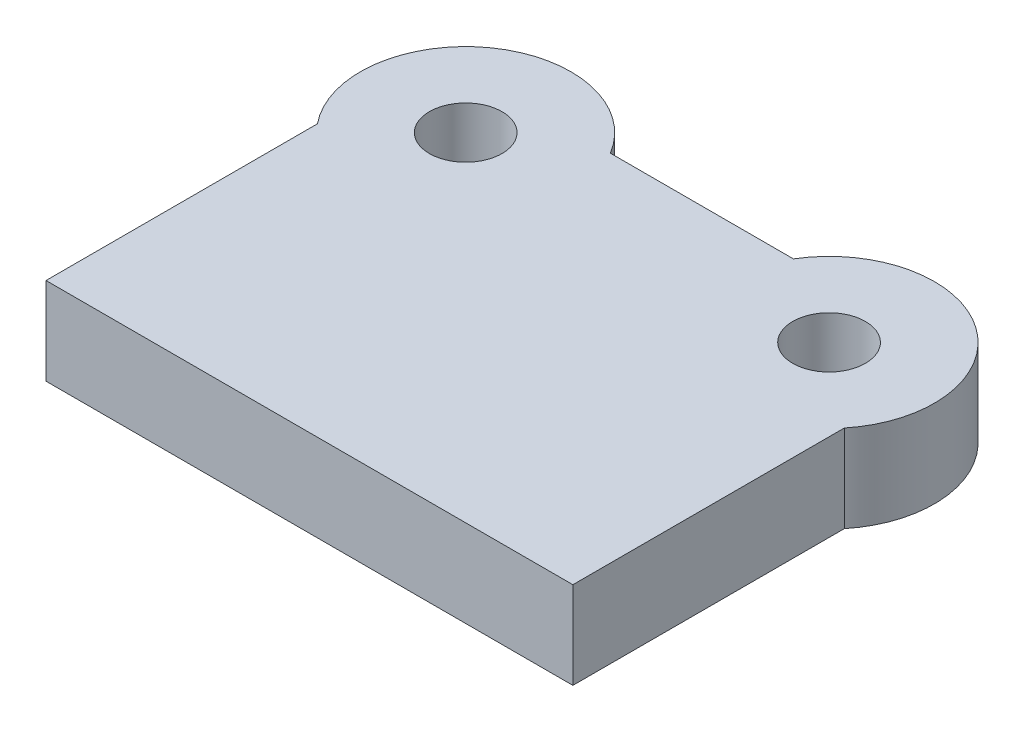
ISO-10303-21;
HEADER;
FILE_DESCRIPTION(('STEP AP214'),'2;1');
FILE_NAME('part.step','',(''),(''),'','','');
FILE_SCHEMA(('AUTOMOTIVE_DESIGN { 1 0 10303 214 1 1 1 1 }'));
ENDSEC;
DATA;
#1=APPLICATION_CONTEXT('core data for automotive mechanical design processes');
#2=APPLICATION_PROTOCOL_DEFINITION('international standard','automotive_design',2000,#1);
#3=PRODUCT_CONTEXT('',#1,'mechanical');
#4=PRODUCT('Part','Part','',(#3));
#5=PRODUCT_RELATED_PRODUCT_CATEGORY('part','',(#4));
#6=PRODUCT_DEFINITION_FORMATION('','',#4);
#7=PRODUCT_DEFINITION_CONTEXT('part definition',#1,'design');
#8=PRODUCT_DEFINITION('design','',#6,#7);
#9=PRODUCT_DEFINITION_SHAPE('','',#8);
#10=(LENGTH_UNIT() NAMED_UNIT(*) SI_UNIT(.MILLI.,.METRE.));
#11=(NAMED_UNIT(*) PLANE_ANGLE_UNIT() SI_UNIT($,.RADIAN.));
#12=(NAMED_UNIT(*) SI_UNIT($,.STERADIAN.) SOLID_ANGLE_UNIT());
#13=UNCERTAINTY_MEASURE_WITH_UNIT(LENGTH_MEASURE(1.E-05),#10,'distance_accuracy_value','');
#14=(GEOMETRIC_REPRESENTATION_CONTEXT(3) GLOBAL_UNCERTAINTY_ASSIGNED_CONTEXT((#13)) GLOBAL_UNIT_ASSIGNED_CONTEXT((#10,
#11,#12)) REPRESENTATION_CONTEXT('',''));
#15=CARTESIAN_POINT('',(0.,0.,0.));
#16=DIRECTION('',(0.,0.,1.));
#17=DIRECTION('',(1.,0.,0.));
#18=AXIS2_PLACEMENT_3D('',#15,#16,#17);
#19=CARTESIAN_POINT('',(-50.,24.,-93.));
#20=DIRECTION('',(0.,1.,0.));
#21=DIRECTION('',(0.,0.,1.));
#22=AXIS2_PLACEMENT_3D('',#19,#20,#21);
#23=PLANE('',#22);
#24=CARTESIAN_POINT('',(-50.,24.,-93.));
#25=DIRECTION('',(0.,1.,0.));
#26=DIRECTION('',(0.,0.,1.));
#27=AXIS2_PLACEMENT_3D('',#24,#25,#26);
#28=CIRCLE('',#27,10.);
#29=CARTESIAN_POINT('',(-50.,24.,-83.));
#30=VERTEX_POINT('',#29);
#31=EDGE_CURVE('E122',#30,#30,#28,.T.);
#32=ORIENTED_EDGE('',*,*,#31,.F.);
#33=EDGE_LOOP('',(#32));
#34=FACE_BOUND('',#33,.T.);
#35=DIRECTION('',(0.,0.,1.));
#36=VECTOR('',#35,1.);
#37=CARTESIAN_POINT('',(-72.5,24.,0.));
#38=LINE('',#37,#36);
#39=CARTESIAN_POINT('',(-72.5,24.,-74.703825536468));
#40=VERTEX_POINT('',#39);
#41=CARTESIAN_POINT('',(-72.5,24.,0.));
#42=VERTEX_POINT('',#41);
#43=EDGE_CURVE('E129',#40,#42,#38,.T.);
#44=ORIENTED_EDGE('',*,*,#43,.T.);
#45=DIRECTION('',(1.,0.,0.));
#46=VECTOR('',#45,1.);
#47=CARTESIAN_POINT('',(72.5,24.,0.));
#48=LINE('',#47,#46);
#49=CARTESIAN_POINT('',(72.5,24.,0.));
#50=VERTEX_POINT('',#49);
#51=EDGE_CURVE('E87',#42,#50,#48,.T.);
#52=ORIENTED_EDGE('',*,*,#51,.T.);
#53=DIRECTION('',(0.,0.,-1.));
#54=VECTOR('',#53,1.);
#55=CARTESIAN_POINT('',(72.5,24.,0.));
#56=LINE('',#55,#54);
#57=CARTESIAN_POINT('',(72.5,24.,-74.703825536468));
#58=VERTEX_POINT('',#57);
#59=EDGE_CURVE('E100',#50,#58,#56,.T.);
#60=ORIENTED_EDGE('',*,*,#59,.T.);
#61=CARTESIAN_POINT('',(50.,24.,-93.));
#62=DIRECTION('',(0.,1.,0.));
#63=DIRECTION('',(0.,0.,-1.));
#64=AXIS2_PLACEMENT_3D('',#61,#62,#63);
#65=CIRCLE('',#64,29.);
#66=CARTESIAN_POINT('',(25.1806527080183,24.,-108.));
#67=VERTEX_POINT('',#66);
#68=EDGE_CURVE('E94',#58,#67,#65,.T.);
#69=ORIENTED_EDGE('',*,*,#68,.T.);
#70=DIRECTION('',(-1.,0.,0.));
#71=VECTOR('',#70,1.);
#72=CARTESIAN_POINT('',(25.1806527080183,24.,-108.));
#73=LINE('',#72,#71);
#74=CARTESIAN_POINT('',(-25.1806527080183,24.,-108.));
#75=VERTEX_POINT('',#74);
#76=EDGE_CURVE('E98',#67,#75,#73,.T.);
#77=ORIENTED_EDGE('',*,*,#76,.T.);
#78=CARTESIAN_POINT('',(-50.,24.,-93.));
#79=DIRECTION('',(0.,1.,0.));
#80=DIRECTION('',(0.,0.,1.));
#81=AXIS2_PLACEMENT_3D('',#78,#79,#80);
#82=CIRCLE('',#81,29.);
#83=EDGE_CURVE('E50',#75,#40,#82,.T.);
#84=ORIENTED_EDGE('',*,*,#83,.T.);
#85=EDGE_LOOP('',(#44,#52,#60,#69,#77,#84));
#86=FACE_BOUND('',#85,.T.);
#87=CARTESIAN_POINT('',(50.,24.,-93.));
#88=DIRECTION('',(0.,1.,0.));
#89=DIRECTION('',(0.,0.,-1.));
#90=AXIS2_PLACEMENT_3D('',#87,#88,#89);
#91=CIRCLE('',#90,10.);
#92=CARTESIAN_POINT('',(50.,24.,-103.));
#93=VERTEX_POINT('',#92);
#94=EDGE_CURVE('E171',#93,#93,#91,.T.);
#95=ORIENTED_EDGE('',*,*,#94,.F.);
#96=EDGE_LOOP('',(#95));
#97=FACE_BOUND('',#96,.T.);
#98=ADVANCED_FACE('F33',(#34,#86,#97),#23,.T.);
#99=CARTESIAN_POINT('',(-50.,0.,-93.));
#100=DIRECTION('',(0.,1.,0.));
#101=DIRECTION('',(0.,0.,1.));
#102=AXIS2_PLACEMENT_3D('',#99,#100,#101);
#103=PLANE('',#102);
#104=DIRECTION('',(0.,0.,1.));
#105=VECTOR('',#104,1.);
#106=CARTESIAN_POINT('',(-72.5,0.,0.));
#107=LINE('',#106,#105);
#108=CARTESIAN_POINT('',(-72.5,0.,-74.703825536468));
#109=VERTEX_POINT('',#108);
#110=CARTESIAN_POINT('',(-72.5,0.,0.));
#111=VERTEX_POINT('',#110);
#112=EDGE_CURVE('E118',#109,#111,#107,.T.);
#113=ORIENTED_EDGE('',*,*,#112,.F.);
#114=CARTESIAN_POINT('',(-50.,0.,-93.));
#115=DIRECTION('',(0.,1.,0.));
#116=DIRECTION('',(0.,0.,1.));
#117=AXIS2_PLACEMENT_3D('',#114,#115,#116);
#118=CIRCLE('',#117,29.);
#119=CARTESIAN_POINT('',(-25.1806527080183,0.,-108.));
#120=VERTEX_POINT('',#119);
#121=EDGE_CURVE('E79',#120,#109,#118,.T.);
#122=ORIENTED_EDGE('',*,*,#121,.F.);
#123=DIRECTION('',(-1.,0.,0.));
#124=VECTOR('',#123,1.);
#125=CARTESIAN_POINT('',(25.1806527080183,0.,-108.));
#126=LINE('',#125,#124);
#127=CARTESIAN_POINT('',(25.1806527080183,0.,-108.));
#128=VERTEX_POINT('',#127);
#129=EDGE_CURVE('E73',#128,#120,#126,.T.);
#130=ORIENTED_EDGE('',*,*,#129,.F.);
#131=CARTESIAN_POINT('',(50.,0.,-93.));
#132=DIRECTION('',(0.,1.,0.));
#133=DIRECTION('',(0.,0.,-1.));
#134=AXIS2_PLACEMENT_3D('',#131,#132,#133);
#135=CIRCLE('',#134,29.);
#136=CARTESIAN_POINT('',(72.5,0.,-74.703825536468));
#137=VERTEX_POINT('',#136);
#138=EDGE_CURVE('E108',#137,#128,#135,.T.);
#139=ORIENTED_EDGE('',*,*,#138,.F.);
#140=DIRECTION('',(0.,0.,-1.));
#141=VECTOR('',#140,1.);
#142=CARTESIAN_POINT('',(72.5,0.,0.));
#143=LINE('',#142,#141);
#144=CARTESIAN_POINT('',(72.5,0.,0.));
#145=VERTEX_POINT('',#144);
#146=EDGE_CURVE('E124',#145,#137,#143,.T.);
#147=ORIENTED_EDGE('',*,*,#146,.F.);
#148=DIRECTION('',(1.,0.,0.));
#149=VECTOR('',#148,1.);
#150=CARTESIAN_POINT('',(72.5,0.,0.));
#151=LINE('',#150,#149);
#152=EDGE_CURVE('E121',#111,#145,#151,.T.);
#153=ORIENTED_EDGE('',*,*,#152,.F.);
#154=EDGE_LOOP('',(#113,#122,#130,#139,#147,#153));
#155=FACE_BOUND('',#154,.T.);
#156=CARTESIAN_POINT('',(-50.,0.,-93.));
#157=DIRECTION('',(0.,1.,0.));
#158=DIRECTION('',(0.,0.,1.));
#159=AXIS2_PLACEMENT_3D('',#156,#157,#158);
#160=CIRCLE('',#159,10.);
#161=CARTESIAN_POINT('',(-50.,0.,-83.));
#162=VERTEX_POINT('',#161);
#163=EDGE_CURVE('E177',#162,#162,#160,.T.);
#164=ORIENTED_EDGE('',*,*,#163,.T.);
#165=EDGE_LOOP('',(#164));
#166=FACE_BOUND('',#165,.T.);
#167=CARTESIAN_POINT('',(50.,0.,-93.));
#168=DIRECTION('',(0.,1.,0.));
#169=DIRECTION('',(0.,0.,-1.));
#170=AXIS2_PLACEMENT_3D('',#167,#168,#169);
#171=CIRCLE('',#170,10.);
#172=CARTESIAN_POINT('',(50.,0.,-103.));
#173=VERTEX_POINT('',#172);
#174=EDGE_CURVE('E174',#173,#173,#171,.T.);
#175=ORIENTED_EDGE('',*,*,#174,.T.);
#176=EDGE_LOOP('',(#175));
#177=FACE_BOUND('',#176,.T.);
#178=ADVANCED_FACE('F138',(#155,#166,#177),#103,.F.);
#179=CARTESIAN_POINT('',(-72.5,24.,0.));
#180=DIRECTION('',(1.,0.,0.));
#181=DIRECTION('',(0.,0.,-1.));
#182=AXIS2_PLACEMENT_3D('',#179,#180,#181);
#183=PLANE('',#182);
#184=ORIENTED_EDGE('',*,*,#112,.T.);
#185=DIRECTION('',(0.,-1.,0.));
#186=VECTOR('',#185,1.);
#187=CARTESIAN_POINT('',(-72.5,24.,0.));
#188=LINE('',#187,#186);
#189=EDGE_CURVE('E11',#42,#111,#188,.T.);
#190=ORIENTED_EDGE('',*,*,#189,.F.);
#191=ORIENTED_EDGE('',*,*,#43,.F.);
#192=DIRECTION('',(0.,-1.,0.));
#193=VECTOR('',#192,1.);
#194=CARTESIAN_POINT('',(-72.5,24.,-74.703825536468));
#195=LINE('',#194,#193);
#196=EDGE_CURVE('E114',#40,#109,#195,.T.);
#197=ORIENTED_EDGE('',*,*,#196,.T.);
#198=EDGE_LOOP('',(#184,#190,#191,#197));
#199=FACE_BOUND('',#198,.T.);
#200=ADVANCED_FACE('F35',(#199),#183,.F.);
#201=CARTESIAN_POINT('',(72.5,24.,0.));
#202=DIRECTION('',(0.,0.,-1.));
#203=DIRECTION('',(-1.,0.,0.));
#204=AXIS2_PLACEMENT_3D('',#201,#202,#203);
#205=PLANE('',#204);
#206=ORIENTED_EDGE('',*,*,#152,.T.);
#207=DIRECTION('',(0.,-1.,0.));
#208=VECTOR('',#207,1.);
#209=CARTESIAN_POINT('',(72.5,24.,0.));
#210=LINE('',#209,#208);
#211=EDGE_CURVE('E42',#50,#145,#210,.T.);
#212=ORIENTED_EDGE('',*,*,#211,.F.);
#213=ORIENTED_EDGE('',*,*,#51,.F.);
#214=ORIENTED_EDGE('',*,*,#189,.T.);
#215=EDGE_LOOP('',(#206,#212,#213,#214));
#216=FACE_BOUND('',#215,.T.);
#217=ADVANCED_FACE('F218',(#216),#205,.F.);
#218=CARTESIAN_POINT('',(72.5,24.,0.));
#219=DIRECTION('',(-1.,0.,0.));
#220=DIRECTION('',(0.,0.,1.));
#221=AXIS2_PLACEMENT_3D('',#218,#219,#220);
#222=PLANE('',#221);
#223=ORIENTED_EDGE('',*,*,#146,.T.);
#224=DIRECTION('',(0.,-1.,0.));
#225=VECTOR('',#224,1.);
#226=CARTESIAN_POINT('',(72.5,24.,-74.703825536468));
#227=LINE('',#226,#225);
#228=EDGE_CURVE('E109',#58,#137,#227,.T.);
#229=ORIENTED_EDGE('',*,*,#228,.F.);
#230=ORIENTED_EDGE('',*,*,#59,.F.);
#231=ORIENTED_EDGE('',*,*,#211,.T.);
#232=EDGE_LOOP('',(#223,#229,#230,#231));
#233=FACE_BOUND('',#232,.T.);
#234=ADVANCED_FACE('F135',(#233),#222,.F.);
#235=CARTESIAN_POINT('',(50.,24.,-93.));
#236=DIRECTION('',(0.,-1.,0.));
#237=DIRECTION('',(0.,0.,-1.));
#238=AXIS2_PLACEMENT_3D('',#235,#236,#237);
#239=CYLINDRICAL_SURFACE('',#238,29.);
#240=ORIENTED_EDGE('',*,*,#138,.T.);
#241=DIRECTION('',(0.,-1.,0.));
#242=VECTOR('',#241,1.);
#243=CARTESIAN_POINT('',(25.1806527080183,24.,-108.));
#244=LINE('',#243,#242);
#245=EDGE_CURVE('E105',#67,#128,#244,.T.);
#246=ORIENTED_EDGE('',*,*,#245,.F.);
#247=ORIENTED_EDGE('',*,*,#68,.F.);
#248=ORIENTED_EDGE('',*,*,#228,.T.);
#249=EDGE_LOOP('',(#240,#246,#247,#248));
#250=FACE_BOUND('',#249,.T.);
#251=ADVANCED_FACE('F106',(#250),#239,.T.);
#252=CARTESIAN_POINT('',(25.1806527080183,24.,-108.));
#253=DIRECTION('',(0.,0.,1.));
#254=DIRECTION('',(1.,0.,0.));
#255=AXIS2_PLACEMENT_3D('',#252,#253,#254);
#256=PLANE('',#255);
#257=ORIENTED_EDGE('',*,*,#129,.T.);
#258=DIRECTION('',(0.,-1.,0.));
#259=VECTOR('',#258,1.);
#260=CARTESIAN_POINT('',(-25.1806527080183,24.,-108.));
#261=LINE('',#260,#259);
#262=EDGE_CURVE('E110',#75,#120,#261,.T.);
#263=ORIENTED_EDGE('',*,*,#262,.F.);
#264=ORIENTED_EDGE('',*,*,#76,.F.);
#265=ORIENTED_EDGE('',*,*,#245,.T.);
#266=EDGE_LOOP('',(#257,#263,#264,#265));
#267=FACE_BOUND('',#266,.T.);
#268=ADVANCED_FACE('F112',(#267),#256,.F.);
#269=CARTESIAN_POINT('',(-50.,24.,-93.));
#270=DIRECTION('',(0.,-1.,0.));
#271=DIRECTION('',(0.,0.,-1.));
#272=AXIS2_PLACEMENT_3D('',#269,#270,#271);
#273=CYLINDRICAL_SURFACE('',#272,29.);
#274=ORIENTED_EDGE('',*,*,#121,.T.);
#275=ORIENTED_EDGE('',*,*,#196,.F.);
#276=ORIENTED_EDGE('',*,*,#83,.F.);
#277=ORIENTED_EDGE('',*,*,#262,.T.);
#278=EDGE_LOOP('',(#274,#275,#276,#277));
#279=FACE_BOUND('',#278,.T.);
#280=ADVANCED_FACE('F143',(#279),#273,.T.);
#281=CARTESIAN_POINT('',(-50.,24.,-93.));
#282=DIRECTION('',(0.,-1.,0.));
#283=DIRECTION('',(0.,0.,-1.));
#284=AXIS2_PLACEMENT_3D('',#281,#282,#283);
#285=CYLINDRICAL_SURFACE('',#284,10.);
#286=ORIENTED_EDGE('',*,*,#31,.T.);
#287=EDGE_LOOP('',(#286));
#288=FACE_BOUND('',#287,.T.);
#289=ORIENTED_EDGE('',*,*,#163,.F.);
#290=EDGE_LOOP('',(#289));
#291=FACE_BOUND('',#290,.T.);
#292=ADVANCED_FACE('F145',(#288,#291),#285,.F.);
#293=CARTESIAN_POINT('',(50.,24.,-93.));
#294=DIRECTION('',(0.,-1.,0.));
#295=DIRECTION('',(0.,0.,-1.));
#296=AXIS2_PLACEMENT_3D('',#293,#294,#295);
#297=CYLINDRICAL_SURFACE('',#296,10.);
#298=ORIENTED_EDGE('',*,*,#94,.T.);
#299=EDGE_LOOP('',(#298));
#300=FACE_BOUND('',#299,.T.);
#301=ORIENTED_EDGE('',*,*,#174,.F.);
#302=EDGE_LOOP('',(#301));
#303=FACE_BOUND('',#302,.T.);
#304=ADVANCED_FACE('F151',(#300,#303),#297,.F.);
#305=CLOSED_SHELL('',(#98,#178,#200,#217,#234,#251,#268,#280,#292,#304));
#306=MANIFOLD_SOLID_BREP('B2',#305);
#307=ADVANCED_BREP_SHAPE_REPRESENTATION('',(#18,#306),#14);
#308=SHAPE_DEFINITION_REPRESENTATION(#9,#307);
ENDSEC;
END-ISO-10303-21;
